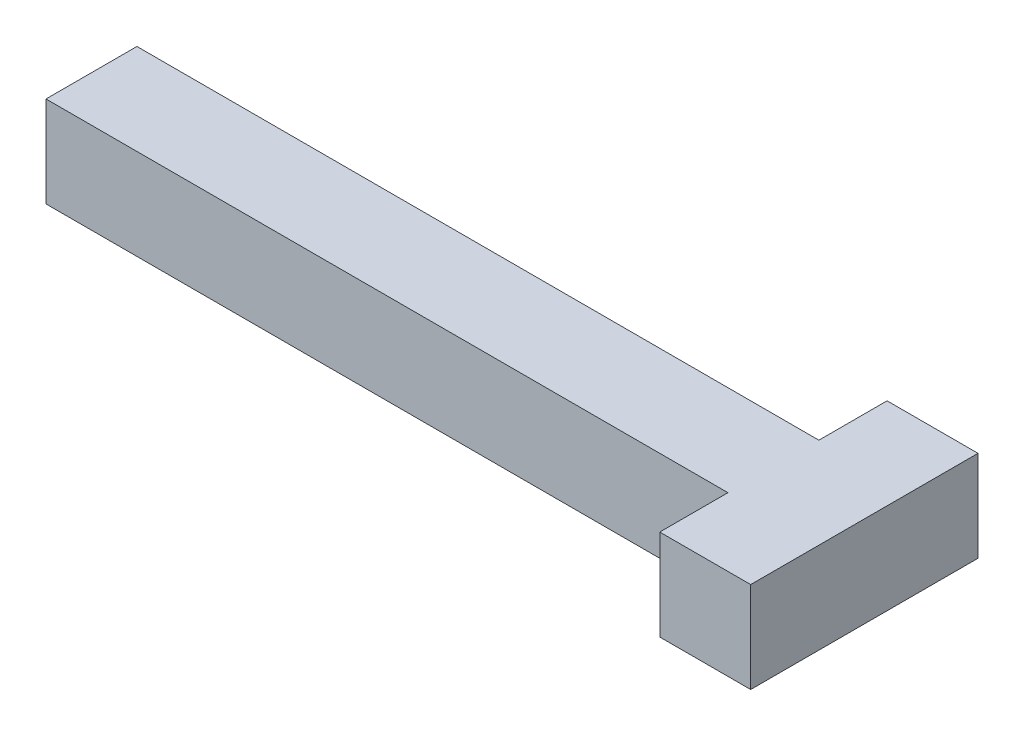
ISO-10303-21;
HEADER;
FILE_DESCRIPTION(('STEP AP214'),'2;1');
FILE_NAME('part.step','',(''),(''),'','','');
FILE_SCHEMA(('AUTOMOTIVE_DESIGN { 1 0 10303 214 1 1 1 1 }'));
ENDSEC;
DATA;
#1=APPLICATION_CONTEXT('core data for automotive mechanical design processes');
#2=APPLICATION_PROTOCOL_DEFINITION('international standard','automotive_design',2000,#1);
#3=PRODUCT_CONTEXT('',#1,'mechanical');
#4=PRODUCT('Part','Part','',(#3));
#5=PRODUCT_RELATED_PRODUCT_CATEGORY('part','',(#4));
#6=PRODUCT_DEFINITION_FORMATION('','',#4);
#7=PRODUCT_DEFINITION_CONTEXT('part definition',#1,'design');
#8=PRODUCT_DEFINITION('design','',#6,#7);
#9=PRODUCT_DEFINITION_SHAPE('','',#8);
#10=(LENGTH_UNIT() NAMED_UNIT(*) SI_UNIT(.MILLI.,.METRE.));
#11=(NAMED_UNIT(*) PLANE_ANGLE_UNIT() SI_UNIT($,.RADIAN.));
#12=(NAMED_UNIT(*) SI_UNIT($,.STERADIAN.) SOLID_ANGLE_UNIT());
#13=UNCERTAINTY_MEASURE_WITH_UNIT(LENGTH_MEASURE(1.E-05),#10,'distance_accuracy_value','');
#14=(GEOMETRIC_REPRESENTATION_CONTEXT(3) GLOBAL_UNCERTAINTY_ASSIGNED_CONTEXT((#13)) GLOBAL_UNIT_ASSIGNED_CONTEXT((#10,
#11,#12)) REPRESENTATION_CONTEXT('',''));
#15=CARTESIAN_POINT('',(0.,0.,0.));
#16=DIRECTION('',(0.,0.,1.));
#17=DIRECTION('',(1.,0.,0.));
#18=AXIS2_PLACEMENT_3D('',#15,#16,#17);
#19=CARTESIAN_POINT('',(0.,2.,1.));
#20=DIRECTION('',(0.,0.,-1.));
#21=DIRECTION('',(-1.,0.,0.));
#22=AXIS2_PLACEMENT_3D('',#19,#20,#21);
#23=PLANE('',#22);
#24=DIRECTION('',(1.,0.,0.));
#25=VECTOR('',#24,1.);
#26=CARTESIAN_POINT('',(0.,0.,1.));
#27=LINE('',#26,#25);
#28=CARTESIAN_POINT('',(-7.5,0.,1.));
#29=VERTEX_POINT('',#28);
#30=CARTESIAN_POINT('',(7.5,0.,1.));
#31=VERTEX_POINT('',#30);
#32=EDGE_CURVE('E150',#29,#31,#27,.T.);
#33=ORIENTED_EDGE('',*,*,#32,.T.);
#34=DIRECTION('',(0.,-1.,0.));
#35=VECTOR('',#34,1.);
#36=CARTESIAN_POINT('',(7.5,2.,1.));
#37=LINE('',#36,#35);
#38=CARTESIAN_POINT('',(7.5,2.,1.));
#39=VERTEX_POINT('',#38);
#40=EDGE_CURVE('E11',#39,#31,#37,.T.);
#41=ORIENTED_EDGE('',*,*,#40,.F.);
#42=DIRECTION('',(1.,0.,0.));
#43=VECTOR('',#42,1.);
#44=CARTESIAN_POINT('',(0.,2.,1.));
#45=LINE('',#44,#43);
#46=CARTESIAN_POINT('',(-7.5,2.,1.));
#47=VERTEX_POINT('',#46);
#48=EDGE_CURVE('E175',#47,#39,#45,.T.);
#49=ORIENTED_EDGE('',*,*,#48,.F.);
#50=DIRECTION('',(0.,-1.,0.));
#51=VECTOR('',#50,1.);
#52=CARTESIAN_POINT('',(-7.5,2.,1.));
#53=LINE('',#52,#51);
#54=EDGE_CURVE('E64',#47,#29,#53,.T.);
#55=ORIENTED_EDGE('',*,*,#54,.T.);
#56=EDGE_LOOP('',(#33,#41,#49,#55));
#57=FACE_BOUND('',#56,.T.);
#58=ADVANCED_FACE('F47',(#57),#23,.F.);
#59=CARTESIAN_POINT('',(7.5,2.,0.));
#60=DIRECTION('',(1.,0.,0.));
#61=DIRECTION('',(0.,0.,-1.));
#62=AXIS2_PLACEMENT_3D('',#59,#60,#61);
#63=PLANE('',#62);
#64=DIRECTION('',(0.,0.,1.));
#65=VECTOR('',#64,1.);
#66=CARTESIAN_POINT('',(7.5,0.,0.));
#67=LINE('',#66,#65);
#68=CARTESIAN_POINT('',(7.5,0.,2.5));
#69=VERTEX_POINT('',#68);
#70=EDGE_CURVE('E153',#31,#69,#67,.T.);
#71=ORIENTED_EDGE('',*,*,#70,.T.);
#72=DIRECTION('',(0.,-1.,0.));
#73=VECTOR('',#72,1.);
#74=CARTESIAN_POINT('',(7.5,2.,2.5));
#75=LINE('',#74,#73);
#76=CARTESIAN_POINT('',(7.5,2.,2.5));
#77=VERTEX_POINT('',#76);
#78=EDGE_CURVE('E56',#77,#69,#75,.T.);
#79=ORIENTED_EDGE('',*,*,#78,.F.);
#80=DIRECTION('',(0.,0.,1.));
#81=VECTOR('',#80,1.);
#82=CARTESIAN_POINT('',(7.5,2.,0.));
#83=LINE('',#82,#81);
#84=EDGE_CURVE('E102',#39,#77,#83,.T.);
#85=ORIENTED_EDGE('',*,*,#84,.F.);
#86=ORIENTED_EDGE('',*,*,#40,.T.);
#87=EDGE_LOOP('',(#71,#79,#85,#86));
#88=FACE_BOUND('',#87,.T.);
#89=ADVANCED_FACE('F211',(#88),#63,.F.);
#90=CARTESIAN_POINT('',(0.,2.,2.5));
#91=DIRECTION('',(0.,0.,-1.));
#92=DIRECTION('',(-1.,0.,0.));
#93=AXIS2_PLACEMENT_3D('',#90,#91,#92);
#94=PLANE('',#93);
#95=DIRECTION('',(1.,0.,0.));
#96=VECTOR('',#95,1.);
#97=CARTESIAN_POINT('',(0.,0.,2.5));
#98=LINE('',#97,#96);
#99=CARTESIAN_POINT('',(9.5,0.,2.5));
#100=VERTEX_POINT('',#99);
#101=EDGE_CURVE('E156',#69,#100,#98,.T.);
#102=ORIENTED_EDGE('',*,*,#101,.T.);
#103=DIRECTION('',(0.,-1.,0.));
#104=VECTOR('',#103,1.);
#105=CARTESIAN_POINT('',(9.5,2.,2.5));
#106=LINE('',#105,#104);
#107=CARTESIAN_POINT('',(9.5,2.,2.5));
#108=VERTEX_POINT('',#107);
#109=EDGE_CURVE('E185',#108,#100,#106,.T.);
#110=ORIENTED_EDGE('',*,*,#109,.F.);
#111=DIRECTION('',(1.,0.,0.));
#112=VECTOR('',#111,1.);
#113=CARTESIAN_POINT('',(0.,2.,2.5));
#114=LINE('',#113,#112);
#115=EDGE_CURVE('E194',#77,#108,#114,.T.);
#116=ORIENTED_EDGE('',*,*,#115,.F.);
#117=ORIENTED_EDGE('',*,*,#78,.T.);
#118=EDGE_LOOP('',(#102,#110,#116,#117));
#119=FACE_BOUND('',#118,.T.);
#120=ADVANCED_FACE('F192',(#119),#94,.F.);
#121=CARTESIAN_POINT('',(9.5,2.,0.));
#122=DIRECTION('',(1.,0.,0.));
#123=DIRECTION('',(0.,0.,-1.));
#124=AXIS2_PLACEMENT_3D('',#121,#122,#123);
#125=PLANE('',#124);
#126=DIRECTION('',(0.,0.,1.));
#127=VECTOR('',#126,1.);
#128=CARTESIAN_POINT('',(9.5,0.,0.));
#129=LINE('',#128,#127);
#130=CARTESIAN_POINT('',(9.5,0.,-2.5));
#131=VERTEX_POINT('',#130);
#132=EDGE_CURVE('E160',#131,#100,#129,.T.);
#133=ORIENTED_EDGE('',*,*,#132,.F.);
#134=DIRECTION('',(0.,-1.,0.));
#135=VECTOR('',#134,1.);
#136=CARTESIAN_POINT('',(9.5,2.,-2.5));
#137=LINE('',#136,#135);
#138=CARTESIAN_POINT('',(9.5,2.,-2.5));
#139=VERTEX_POINT('',#138);
#140=EDGE_CURVE('E182',#139,#131,#137,.T.);
#141=ORIENTED_EDGE('',*,*,#140,.F.);
#142=DIRECTION('',(0.,0.,1.));
#143=VECTOR('',#142,1.);
#144=CARTESIAN_POINT('',(9.5,2.,0.));
#145=LINE('',#144,#143);
#146=EDGE_CURVE('E202',#139,#108,#145,.T.);
#147=ORIENTED_EDGE('',*,*,#146,.T.);
#148=ORIENTED_EDGE('',*,*,#109,.T.);
#149=EDGE_LOOP('',(#133,#141,#147,#148));
#150=FACE_BOUND('',#149,.T.);
#151=ADVANCED_FACE('F200',(#150),#125,.T.);
#152=CARTESIAN_POINT('',(0.,2.,-2.5));
#153=DIRECTION('',(0.,0.,-1.));
#154=DIRECTION('',(-1.,0.,0.));
#155=AXIS2_PLACEMENT_3D('',#152,#153,#154);
#156=PLANE('',#155);
#157=DIRECTION('',(1.,0.,0.));
#158=VECTOR('',#157,1.);
#159=CARTESIAN_POINT('',(0.,0.,-2.5));
#160=LINE('',#159,#158);
#161=CARTESIAN_POINT('',(7.5,0.,-2.5));
#162=VERTEX_POINT('',#161);
#163=EDGE_CURVE('E164',#162,#131,#160,.T.);
#164=ORIENTED_EDGE('',*,*,#163,.F.);
#165=DIRECTION('',(0.,-1.,0.));
#166=VECTOR('',#165,1.);
#167=CARTESIAN_POINT('',(7.5,2.,-2.5));
#168=LINE('',#167,#166);
#169=CARTESIAN_POINT('',(7.5,2.,-2.5));
#170=VERTEX_POINT('',#169);
#171=EDGE_CURVE('E139',#170,#162,#168,.T.);
#172=ORIENTED_EDGE('',*,*,#171,.F.);
#173=DIRECTION('',(1.,0.,0.));
#174=VECTOR('',#173,1.);
#175=CARTESIAN_POINT('',(0.,2.,-2.5));
#176=LINE('',#175,#174);
#177=EDGE_CURVE('E127',#170,#139,#176,.T.);
#178=ORIENTED_EDGE('',*,*,#177,.T.);
#179=ORIENTED_EDGE('',*,*,#140,.T.);
#180=EDGE_LOOP('',(#164,#172,#178,#179));
#181=FACE_BOUND('',#180,.T.);
#182=ADVANCED_FACE('F221',(#181),#156,.T.);
#183=CARTESIAN_POINT('',(7.5,0.,-1.));
#184=VERTEX_POINT('',#183);
#185=EDGE_CURVE('E135',#162,#184,#67,.T.);
#186=ORIENTED_EDGE('',*,*,#185,.T.);
#187=DIRECTION('',(0.,-1.,0.));
#188=VECTOR('',#187,1.);
#189=CARTESIAN_POINT('',(7.5,2.,-1.));
#190=LINE('',#189,#188);
#191=CARTESIAN_POINT('',(7.5,2.,-1.));
#192=VERTEX_POINT('',#191);
#193=EDGE_CURVE('E132',#192,#184,#190,.T.);
#194=ORIENTED_EDGE('',*,*,#193,.F.);
#195=EDGE_CURVE('E119',#170,#192,#83,.T.);
#196=ORIENTED_EDGE('',*,*,#195,.F.);
#197=ORIENTED_EDGE('',*,*,#171,.T.);
#198=EDGE_LOOP('',(#186,#194,#196,#197));
#199=FACE_BOUND('',#198,.T.);
#200=ADVANCED_FACE('F133',(#199),#63,.F.);
#201=CARTESIAN_POINT('',(0.,2.,-1.));
#202=DIRECTION('',(0.,0.,-1.));
#203=DIRECTION('',(-1.,0.,0.));
#204=AXIS2_PLACEMENT_3D('',#201,#202,#203);
#205=PLANE('',#204);
#206=DIRECTION('',(1.,0.,0.));
#207=VECTOR('',#206,1.);
#208=CARTESIAN_POINT('',(0.,0.,-1.));
#209=LINE('',#208,#207);
#210=CARTESIAN_POINT('',(-7.5,0.,-1.));
#211=VERTEX_POINT('',#210);
#212=EDGE_CURVE('E168',#211,#184,#209,.T.);
#213=ORIENTED_EDGE('',*,*,#212,.F.);
#214=DIRECTION('',(0.,-1.,0.));
#215=VECTOR('',#214,1.);
#216=CARTESIAN_POINT('',(-7.5,2.,-1.));
#217=LINE('',#216,#215);
#218=CARTESIAN_POINT('',(-7.5,2.,-1.));
#219=VERTEX_POINT('',#218);
#220=EDGE_CURVE('E90',#219,#211,#217,.T.);
#221=ORIENTED_EDGE('',*,*,#220,.F.);
#222=DIRECTION('',(1.,0.,0.));
#223=VECTOR('',#222,1.);
#224=CARTESIAN_POINT('',(0.,2.,-1.));
#225=LINE('',#224,#223);
#226=EDGE_CURVE('E124',#219,#192,#225,.T.);
#227=ORIENTED_EDGE('',*,*,#226,.T.);
#228=ORIENTED_EDGE('',*,*,#193,.T.);
#229=EDGE_LOOP('',(#213,#221,#227,#228));
#230=FACE_BOUND('',#229,.T.);
#231=ADVANCED_FACE('F141',(#230),#205,.T.);
#232=CARTESIAN_POINT('',(-7.5,2.,0.));
#233=DIRECTION('',(-1.,0.,0.));
#234=DIRECTION('',(0.,0.,1.));
#235=AXIS2_PLACEMENT_3D('',#232,#233,#234);
#236=PLANE('',#235);
#237=DIRECTION('',(0.,0.,-1.));
#238=VECTOR('',#237,1.);
#239=CARTESIAN_POINT('',(-7.5,0.,0.));
#240=LINE('',#239,#238);
#241=EDGE_CURVE('E171',#29,#211,#240,.T.);
#242=ORIENTED_EDGE('',*,*,#241,.F.);
#243=ORIENTED_EDGE('',*,*,#54,.F.);
#244=DIRECTION('',(0.,0.,-1.));
#245=VECTOR('',#244,1.);
#246=CARTESIAN_POINT('',(-7.5,2.,0.));
#247=LINE('',#246,#245);
#248=EDGE_CURVE('E143',#47,#219,#247,.T.);
#249=ORIENTED_EDGE('',*,*,#248,.T.);
#250=ORIENTED_EDGE('',*,*,#220,.T.);
#251=EDGE_LOOP('',(#242,#243,#249,#250));
#252=FACE_BOUND('',#251,.T.);
#253=ADVANCED_FACE('F226',(#252),#236,.T.);
#254=CARTESIAN_POINT('',(0.,2.,0.));
#255=DIRECTION('',(0.,1.,0.));
#256=DIRECTION('',(0.,0.,1.));
#257=AXIS2_PLACEMENT_3D('',#254,#255,#256);
#258=PLANE('',#257);
#259=ORIENTED_EDGE('',*,*,#48,.T.);
#260=ORIENTED_EDGE('',*,*,#84,.T.);
#261=ORIENTED_EDGE('',*,*,#115,.T.);
#262=ORIENTED_EDGE('',*,*,#146,.F.);
#263=ORIENTED_EDGE('',*,*,#177,.F.);
#264=ORIENTED_EDGE('',*,*,#195,.T.);
#265=ORIENTED_EDGE('',*,*,#226,.F.);
#266=ORIENTED_EDGE('',*,*,#248,.F.);
#267=EDGE_LOOP('',(#259,#260,#261,#262,#263,#264,#265,#266));
#268=FACE_BOUND('',#267,.T.);
#269=ADVANCED_FACE('F121',(#268),#258,.T.);
#270=CARTESIAN_POINT('',(0.,0.,0.));
#271=DIRECTION('',(0.,1.,0.));
#272=DIRECTION('',(0.,0.,1.));
#273=AXIS2_PLACEMENT_3D('',#270,#271,#272);
#274=PLANE('',#273);
#275=ORIENTED_EDGE('',*,*,#32,.F.);
#276=ORIENTED_EDGE('',*,*,#241,.T.);
#277=ORIENTED_EDGE('',*,*,#212,.T.);
#278=ORIENTED_EDGE('',*,*,#185,.F.);
#279=ORIENTED_EDGE('',*,*,#163,.T.);
#280=ORIENTED_EDGE('',*,*,#132,.T.);
#281=ORIENTED_EDGE('',*,*,#101,.F.);
#282=ORIENTED_EDGE('',*,*,#70,.F.);
#283=EDGE_LOOP('',(#275,#276,#277,#278,#279,#280,#281,#282));
#284=FACE_BOUND('',#283,.T.);
#285=ADVANCED_FACE('F196',(#284),#274,.F.);
#286=CLOSED_SHELL('',(#58,#89,#120,#151,#182,#200,#231,#253,#269,#285));
#287=MANIFOLD_SOLID_BREP('B2',#286);
#288=ADVANCED_BREP_SHAPE_REPRESENTATION('',(#18,#287),#14);
#289=SHAPE_DEFINITION_REPRESENTATION(#9,#288);
ENDSEC;
END-ISO-10303-21;
